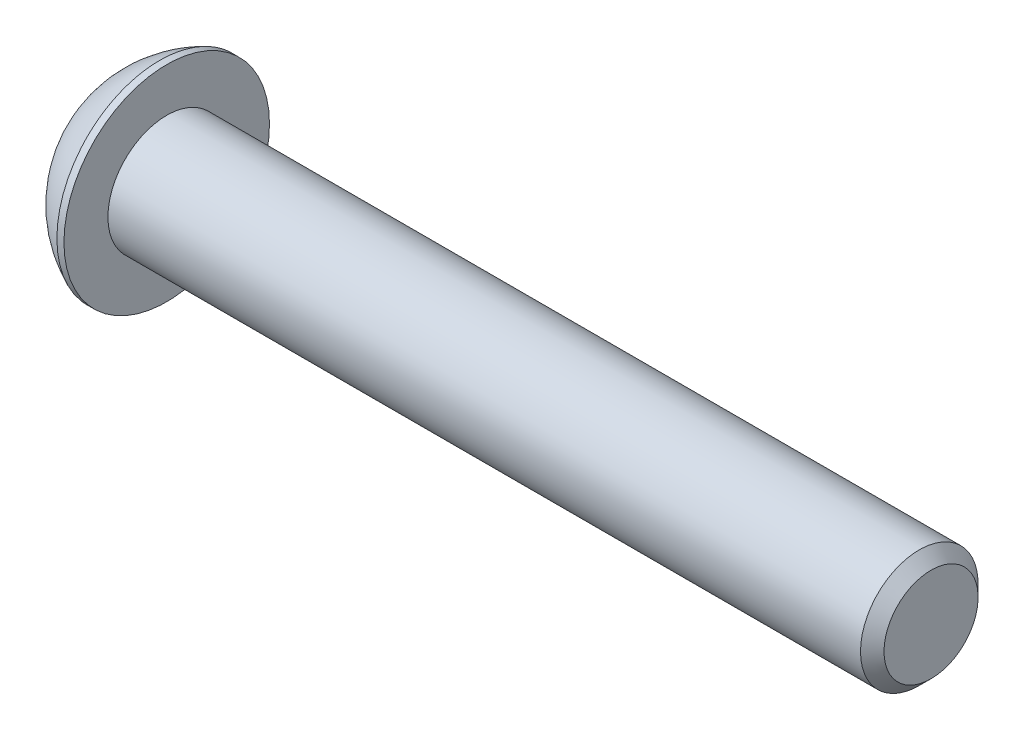
ISO-10303-21;
HEADER;
FILE_DESCRIPTION(('STEP AP214'),'2;1');
FILE_NAME('part.step','',(''),(''),'','','');
FILE_SCHEMA(('AUTOMOTIVE_DESIGN { 1 0 10303 214 1 1 1 1 }'));
ENDSEC;
DATA;
#1=APPLICATION_CONTEXT('core data for automotive mechanical design processes');
#2=APPLICATION_PROTOCOL_DEFINITION('international standard','automotive_design',2000,#1);
#3=PRODUCT_CONTEXT('',#1,'mechanical');
#4=PRODUCT('Part','Part','',(#3));
#5=PRODUCT_RELATED_PRODUCT_CATEGORY('part','',(#4));
#6=PRODUCT_DEFINITION_FORMATION('','',#4);
#7=PRODUCT_DEFINITION_CONTEXT('part definition',#1,'design');
#8=PRODUCT_DEFINITION('design','',#6,#7);
#9=PRODUCT_DEFINITION_SHAPE('','',#8);
#10=(LENGTH_UNIT() NAMED_UNIT(*) SI_UNIT(.MILLI.,.METRE.));
#11=(NAMED_UNIT(*) PLANE_ANGLE_UNIT() SI_UNIT($,.RADIAN.));
#12=(NAMED_UNIT(*) SI_UNIT($,.STERADIAN.) SOLID_ANGLE_UNIT());
#13=UNCERTAINTY_MEASURE_WITH_UNIT(LENGTH_MEASURE(1.E-05),#10,'distance_accuracy_value','');
#14=(GEOMETRIC_REPRESENTATION_CONTEXT(3) GLOBAL_UNCERTAINTY_ASSIGNED_CONTEXT((#13)) GLOBAL_UNIT_ASSIGNED_CONTEXT((#10,
#11,#12)) REPRESENTATION_CONTEXT('',''));
#15=CARTESIAN_POINT('',(0.,0.,0.));
#16=DIRECTION('',(0.,0.,1.));
#17=DIRECTION('',(1.,0.,0.));
#18=AXIS2_PLACEMENT_3D('',#15,#16,#17);
#19=CARTESIAN_POINT('',(1.32080000000034,0.,0.));
#20=DIRECTION('',(-1.,0.,0.));
#21=DIRECTION('',(0.,0.,1.));
#22=AXIS2_PLACEMENT_3D('',#19,#20,#21);
#23=CONICAL_SURFACE('',#22,1.1937999999998,1.04719755119608);
#24=CARTESIAN_POINT('',(2.01004075135902,0.,-4.44089209850063E-13));
#25=VERTEX_POINT('',#24);
#26=VERTEX_LOOP('',#25);
#27=FACE_BOUND('',#26,.T.);
#28=CARTESIAN_POINT('',(1.32080000000009,0.,0.));
#29=DIRECTION('',(-1.,0.,0.));
#30=DIRECTION('',(0.,0.,1.));
#31=AXIS2_PLACEMENT_3D('',#28,#29,#30);
#32=CIRCLE('',#31,1.19380000000024);
#33=CARTESIAN_POINT('',(1.32080000000009,0.,1.19380000000024));
#34=VERTEX_POINT('',#33);
#35=EDGE_CURVE('E20',#34,#34,#32,.T.);
#36=ORIENTED_EDGE('',*,*,#35,.T.);
#37=EDGE_LOOP('',(#36));
#38=FACE_BOUND('',#37,.T.);
#39=ADVANCED_FACE('F17',(#27,#38),#23,.F.);
#40=CARTESIAN_POINT('',(1.3208,-2.29135888084633,0.));
#41=DIRECTION('',(1.,0.,0.));
#42=DIRECTION('',(0.,0.,-1.));
#43=AXIS2_PLACEMENT_3D('',#40,#41,#42);
#44=PLANE('',#43);
#45=DIRECTION('',(0.,1.,0.));
#46=VECTOR('',#45,1.);
#47=CARTESIAN_POINT('',(1.3208,-1.14567944042316,1.984375));
#48=LINE('',#47,#46);
#49=CARTESIAN_POINT('',(1.3208,1.14567944042316,1.984375));
#50=VERTEX_POINT('',#49);
#51=CARTESIAN_POINT('',(1.3208,-1.14567944042316,1.984375));
#52=VERTEX_POINT('',#51);
#53=EDGE_CURVE('E69',#50,#52,#48,.F.);
#54=ORIENTED_EDGE('',*,*,#53,.F.);
#55=DIRECTION('',(0.,0.5,-0.866025403784439));
#56=VECTOR('',#55,1.);
#57=CARTESIAN_POINT('',(1.3208,1.14567944042316,1.984375));
#58=LINE('',#57,#56);
#59=CARTESIAN_POINT('',(1.3208,2.29135888084633,0.));
#60=VERTEX_POINT('',#59);
#61=EDGE_CURVE('E287',#60,#50,#58,.F.);
#62=ORIENTED_EDGE('',*,*,#61,.F.);
#63=DIRECTION('',(0.,-0.5,-0.866025403784439));
#64=VECTOR('',#63,1.);
#65=CARTESIAN_POINT('',(1.3208,2.29135888084633,0.));
#66=LINE('',#65,#64);
#67=CARTESIAN_POINT('',(1.3208,1.14567944042316,-1.984375));
#68=VERTEX_POINT('',#67);
#69=EDGE_CURVE('E291',#68,#60,#66,.F.);
#70=ORIENTED_EDGE('',*,*,#69,.F.);
#71=DIRECTION('',(0.,1.,0.));
#72=VECTOR('',#71,1.);
#73=CARTESIAN_POINT('',(1.3208,1.14567944042316,-1.984375));
#74=LINE('',#73,#72);
#75=CARTESIAN_POINT('',(1.3208,-1.14567944042316,-1.984375));
#76=VERTEX_POINT('',#75);
#77=EDGE_CURVE('E296',#76,#68,#74,.T.);
#78=ORIENTED_EDGE('',*,*,#77,.F.);
#79=DIRECTION('',(0.,-0.500000000000001,0.866025403784438));
#80=VECTOR('',#79,1.);
#81=CARTESIAN_POINT('',(1.3208,-1.14567944042316,-1.984375));
#82=LINE('',#81,#80);
#83=CARTESIAN_POINT('',(1.3208,-2.29135888084633,0.));
#84=VERTEX_POINT('',#83);
#85=EDGE_CURVE('E301',#84,#76,#82,.F.);
#86=ORIENTED_EDGE('',*,*,#85,.F.);
#87=DIRECTION('',(0.,0.500000000000001,0.866025403784438));
#88=VECTOR('',#87,1.);
#89=CARTESIAN_POINT('',(1.3208,-2.29135888084633,0.));
#90=LINE('',#89,#88);
#91=EDGE_CURVE('E82',#52,#84,#90,.F.);
#92=ORIENTED_EDGE('',*,*,#91,.F.);
#93=EDGE_LOOP('',(#54,#62,#70,#78,#86,#92));
#94=FACE_BOUND('',#93,.T.);
#95=ORIENTED_EDGE('',*,*,#35,.F.);
#96=EDGE_LOOP('',(#95));
#97=FACE_BOUND('',#96,.T.);
#98=ADVANCED_FACE('F75',(#94,#97),#44,.F.);
#99=CARTESIAN_POINT('',(1.3208,-1.14567944042316,1.984375));
#100=DIRECTION('',(0.,0.,-1.));
#101=DIRECTION('',(0.,1.,0.));
#102=AXIS2_PLACEMENT_3D('',#99,#100,#101);
#103=PLANE('',#102);
#104=ORIENTED_EDGE('',*,*,#53,.T.);
#105=DIRECTION('',(1.,0.,0.));
#106=VECTOR('',#105,1.);
#107=CARTESIAN_POINT('',(1.3208,-1.14567944042316,1.984375));
#108=LINE('',#107,#106);
#109=CARTESIAN_POINT('',(0.,-1.14567944042316,1.984375));
#110=VERTEX_POINT('',#109);
#111=EDGE_CURVE('E79',#110,#52,#108,.T.);
#112=ORIENTED_EDGE('',*,*,#111,.F.);
#113=DIRECTION('',(0.,1.,0.));
#114=VECTOR('',#113,1.);
#115=CARTESIAN_POINT('',(0.,0.,1.984375));
#116=LINE('',#115,#114);
#117=CARTESIAN_POINT('',(0.,1.14567944042316,1.984375));
#118=VERTEX_POINT('',#117);
#119=EDGE_CURVE('E281',#118,#110,#116,.F.);
#120=ORIENTED_EDGE('',*,*,#119,.F.);
#121=DIRECTION('',(1.,0.,0.));
#122=VECTOR('',#121,1.);
#123=CARTESIAN_POINT('',(1.3208,1.14567944042316,1.984375));
#124=LINE('',#123,#122);
#125=EDGE_CURVE('E284',#50,#118,#124,.F.);
#126=ORIENTED_EDGE('',*,*,#125,.F.);
#127=EDGE_LOOP('',(#104,#112,#120,#126));
#128=FACE_BOUND('',#127,.T.);
#129=ADVANCED_FACE('F128',(#128),#103,.T.);
#130=CARTESIAN_POINT('',(1.3208,-2.29135888084633,0.));
#131=DIRECTION('',(0.,0.866025403784438,-0.500000000000001));
#132=DIRECTION('',(0.,0.500000000000001,0.866025403784438));
#133=AXIS2_PLACEMENT_3D('',#130,#131,#132);
#134=PLANE('',#133);
#135=ORIENTED_EDGE('',*,*,#91,.T.);
#136=DIRECTION('',(1.,0.,0.));
#137=VECTOR('',#136,1.);
#138=CARTESIAN_POINT('',(1.3208,-2.29135888084633,0.));
#139=LINE('',#138,#137);
#140=CARTESIAN_POINT('',(0.,-2.29135888084633,0.));
#141=VERTEX_POINT('',#140);
#142=EDGE_CURVE('E303',#141,#84,#139,.T.);
#143=ORIENTED_EDGE('',*,*,#142,.F.);
#144=DIRECTION('',(0.,-0.500000000000001,-0.866025403784438));
#145=VECTOR('',#144,1.);
#146=CARTESIAN_POINT('',(0.,-1.14567944042316,1.984375));
#147=LINE('',#146,#145);
#148=EDGE_CURVE('E278',#110,#141,#147,.T.);
#149=ORIENTED_EDGE('',*,*,#148,.F.);
#150=ORIENTED_EDGE('',*,*,#111,.T.);
#151=EDGE_LOOP('',(#135,#143,#149,#150));
#152=FACE_BOUND('',#151,.T.);
#153=ADVANCED_FACE('F124',(#152),#134,.T.);
#154=CARTESIAN_POINT('',(1.3208,-1.14567944042316,-1.984375));
#155=DIRECTION('',(0.,0.866025403784438,0.500000000000001));
#156=DIRECTION('',(0.,-0.500000000000001,0.866025403784438));
#157=AXIS2_PLACEMENT_3D('',#154,#155,#156);
#158=PLANE('',#157);
#159=ORIENTED_EDGE('',*,*,#85,.T.);
#160=DIRECTION('',(1.,0.,0.));
#161=VECTOR('',#160,1.);
#162=CARTESIAN_POINT('',(1.3208,-1.14567944042316,-1.984375));
#163=LINE('',#162,#161);
#164=CARTESIAN_POINT('',(0.,-1.14567944042316,-1.984375));
#165=VERTEX_POINT('',#164);
#166=EDGE_CURVE('E298',#165,#76,#163,.T.);
#167=ORIENTED_EDGE('',*,*,#166,.F.);
#168=DIRECTION('',(0.,0.500000000000001,-0.866025403784438));
#169=VECTOR('',#168,1.);
#170=CARTESIAN_POINT('',(0.,-2.29135888084633,0.));
#171=LINE('',#170,#169);
#172=EDGE_CURVE('E275',#141,#165,#171,.T.);
#173=ORIENTED_EDGE('',*,*,#172,.F.);
#174=ORIENTED_EDGE('',*,*,#142,.T.);
#175=EDGE_LOOP('',(#159,#167,#173,#174));
#176=FACE_BOUND('',#175,.T.);
#177=ADVANCED_FACE('F120',(#176),#158,.T.);
#178=CARTESIAN_POINT('',(1.3208,1.14567944042316,-1.984375));
#179=DIRECTION('',(0.,0.,1.));
#180=DIRECTION('',(1.,0.,0.));
#181=AXIS2_PLACEMENT_3D('',#178,#179,#180);
#182=PLANE('',#181);
#183=ORIENTED_EDGE('',*,*,#77,.T.);
#184=DIRECTION('',(1.,0.,0.));
#185=VECTOR('',#184,1.);
#186=CARTESIAN_POINT('',(1.3208,1.14567944042316,-1.984375));
#187=LINE('',#186,#185);
#188=CARTESIAN_POINT('',(0.,1.14567944042316,-1.984375));
#189=VERTEX_POINT('',#188);
#190=EDGE_CURVE('E293',#189,#68,#187,.T.);
#191=ORIENTED_EDGE('',*,*,#190,.F.);
#192=DIRECTION('',(0.,1.,0.));
#193=VECTOR('',#192,1.);
#194=CARTESIAN_POINT('',(0.,0.,-1.984375));
#195=LINE('',#194,#193);
#196=EDGE_CURVE('E272',#165,#189,#195,.T.);
#197=ORIENTED_EDGE('',*,*,#196,.F.);
#198=ORIENTED_EDGE('',*,*,#166,.T.);
#199=EDGE_LOOP('',(#183,#191,#197,#198));
#200=FACE_BOUND('',#199,.T.);
#201=ADVANCED_FACE('F117',(#200),#182,.T.);
#202=CARTESIAN_POINT('',(1.3208,2.29135888084633,0.));
#203=DIRECTION('',(0.,-0.866025403784439,0.5));
#204=DIRECTION('',(0.,-0.5,-0.866025403784439));
#205=AXIS2_PLACEMENT_3D('',#202,#203,#204);
#206=PLANE('',#205);
#207=ORIENTED_EDGE('',*,*,#69,.T.);
#208=DIRECTION('',(1.,0.,0.));
#209=VECTOR('',#208,1.);
#210=CARTESIAN_POINT('',(1.3208,2.29135888084633,0.));
#211=LINE('',#210,#209);
#212=CARTESIAN_POINT('',(0.,2.29135888084633,0.));
#213=VERTEX_POINT('',#212);
#214=EDGE_CURVE('E35',#213,#60,#211,.T.);
#215=ORIENTED_EDGE('',*,*,#214,.F.);
#216=DIRECTION('',(0.,0.5,0.866025403784439));
#217=VECTOR('',#216,1.);
#218=CARTESIAN_POINT('',(0.,1.14567944042316,-1.984375));
#219=LINE('',#218,#217);
#220=EDGE_CURVE('E269',#189,#213,#219,.T.);
#221=ORIENTED_EDGE('',*,*,#220,.F.);
#222=ORIENTED_EDGE('',*,*,#190,.T.);
#223=EDGE_LOOP('',(#207,#215,#221,#222));
#224=FACE_BOUND('',#223,.T.);
#225=ADVANCED_FACE('F113',(#224),#206,.T.);
#226=CARTESIAN_POINT('',(1.3208,1.14567944042316,1.984375));
#227=DIRECTION('',(0.,-0.866025403784439,-0.5));
#228=DIRECTION('',(0.,0.5,-0.866025403784439));
#229=AXIS2_PLACEMENT_3D('',#226,#227,#228);
#230=PLANE('',#229);
#231=ORIENTED_EDGE('',*,*,#61,.T.);
#232=ORIENTED_EDGE('',*,*,#125,.T.);
#233=DIRECTION('',(0.,-0.5,0.866025403784438));
#234=VECTOR('',#233,1.);
#235=CARTESIAN_POINT('',(0.,2.29135888084633,0.));
#236=LINE('',#235,#234);
#237=EDGE_CURVE('E100',#213,#118,#236,.T.);
#238=ORIENTED_EDGE('',*,*,#237,.F.);
#239=ORIENTED_EDGE('',*,*,#214,.T.);
#240=EDGE_LOOP('',(#231,#232,#238,#239));
#241=FACE_BOUND('',#240,.T.);
#242=ADVANCED_FACE('F109',(#241),#230,.T.);
#243=CARTESIAN_POINT('',(0.,0.,0.));
#244=DIRECTION('',(-1.,0.,0.));
#245=DIRECTION('',(0.,0.,1.));
#246=AXIS2_PLACEMENT_3D('',#243,#244,#245);
#247=PLANE('',#246);
#248=ORIENTED_EDGE('',*,*,#220,.T.);
#249=ORIENTED_EDGE('',*,*,#237,.T.);
#250=ORIENTED_EDGE('',*,*,#119,.T.);
#251=ORIENTED_EDGE('',*,*,#148,.T.);
#252=ORIENTED_EDGE('',*,*,#172,.T.);
#253=ORIENTED_EDGE('',*,*,#196,.T.);
#254=EDGE_LOOP('',(#248,#249,#250,#251,#252,#253));
#255=FACE_BOUND('',#254,.T.);
#256=CARTESIAN_POINT('',(0.,2.77495,0.));
#257=CARTESIAN_POINT('',(0.,2.77494953309947,0.0779118937523459));
#258=CARTESIAN_POINT('',(0.,2.77166578388025,0.15583810591977));
#259=CARTESIAN_POINT('',(0.,2.75855213600204,0.311152012455904));
#260=CARTESIAN_POINT('',(0.,2.74872030471467,0.388539541019556));
#261=CARTESIAN_POINT('',(0.,2.72255472645676,0.542341518735717));
#262=CARTESIAN_POINT('',(-2.70414110576258E-13,2.70621065843663,0.618754223567578));
#263=CARTESIAN_POINT('',(2.71501725221868E-13,2.66713326915777,0.769973634286023));
#264=CARTESIAN_POINT('',(1.01274952524446E-12,2.64439476297869,0.844778983646282));
#265=CARTESIAN_POINT('',(1.81909959813207E-12,2.56690195943351,1.06566239301792));
#266=CARTESIAN_POINT('',(4.77081687541822E-13,2.50280672569928,1.20857954243987));
#267=CARTESIAN_POINT('',(-4.76232447128612E-13,2.35149826934097,1.48160874561538));
#268=CARTESIAN_POINT('',(0.,2.26428416790397,1.61172031233499));
#269=CARTESIAN_POINT('',(0.,2.1181093928834,1.79445660654268));
#270=CARTESIAN_POINT('',(0.,2.06678693791626,1.85333128513996));
#271=CARTESIAN_POINT('',(0.,1.95940522984449,1.96650727912792));
#272=CARTESIAN_POINT('',(0.,1.90335059143535,2.02081294920044));
#273=CARTESIAN_POINT('',(0.,1.78683891013963,2.12453280878582));
#274=CARTESIAN_POINT('',(0.,1.72637988450322,2.1739447713554));
#275=CARTESIAN_POINT('',(0.,1.60151968865711,2.26750481692908));
#276=CARTESIAN_POINT('',(0.,1.53711760864537,2.31165167810847));
#277=CARTESIAN_POINT('',(0.,1.33869902291632,2.43567242603944));
#278=CARTESIAN_POINT('',(0.,1.19934704110695,2.507235886628));
#279=CARTESIAN_POINT('',(0.,0.910681609121881,2.62590828672821));
#280=CARTESIAN_POINT('',(0.,0.761368265357398,2.67301748742278));
#281=CARTESIAN_POINT('',(0.,0.456932649466623,2.74151230664007));
#282=CARTESIAN_POINT('',(0.,0.301810346322584,2.76289778778721));
#283=CARTESIAN_POINT('',(0.,-0.00982263870895171,2.77931595661156));
#284=CARTESIAN_POINT('',(0.,-0.166333320596448,2.77434864428877));
#285=CARTESIAN_POINT('',(0.,-0.476280836814452,2.73822217653073));
#286=CARTESIAN_POINT('',(0.,-0.629717687555985,2.70706316096981));
#287=CARTESIAN_POINT('',(0.,-0.929254830044274,2.61937980771149));
#288=CARTESIAN_POINT('',(0.,-1.0753550434132,2.56285519909568));
#289=CARTESIAN_POINT('',(0.,-1.28570692598579,2.46037024128109));
#290=CARTESIAN_POINT('',(0.,-1.35439130022287,2.42323494812896));
#291=CARTESIAN_POINT('',(0.,-1.488391287199,2.34331277270256));
#292=CARTESIAN_POINT('',(0.,-1.55370767631787,2.30052720108831));
#293=CARTESIAN_POINT('',(0.,-1.68047292776594,2.20962421887055));
#294=CARTESIAN_POINT('',(0.,-1.7419235278682,2.16150923122348));
#295=CARTESIAN_POINT('',(0.,-1.86060297067992,2.06024311301283));
#296=CARTESIAN_POINT('',(0.,-1.91782768181715,2.0070871669763));
#297=CARTESIAN_POINT('',(0.,-2.08239462196651,1.8407220856554));
#298=CARTESIAN_POINT('',(0.,-2.18279764272601,1.72049499758422));
#299=CARTESIAN_POINT('',(0.,-2.36195754944063,1.46487629213018));
#300=CARTESIAN_POINT('',(0.,-2.44071525816758,1.32948525142807));
#301=CARTESIAN_POINT('',(0.,-2.54098882695274,1.11796734074395));
#302=CARTESIAN_POINT('',(0.,-2.57146177392727,1.04596540008347));
#303=CARTESIAN_POINT('',(0.,-2.62621251108999,0.899689259475764));
#304=CARTESIAN_POINT('',(0.,-2.65049531495563,0.825416953360952));
#305=CARTESIAN_POINT('',(0.,-2.69267708798766,0.675215808695207));
#306=CARTESIAN_POINT('',(0.,-2.71058613777937,0.599289789313092));
#307=CARTESIAN_POINT('',(0.,-2.73994710360127,0.446213628496932));
#308=CARTESIAN_POINT('',(0.,-2.75140092413871,0.369063855024788));
#309=CARTESIAN_POINT('',(0.,-2.76470470685522,0.24316208817343));
#310=CARTESIAN_POINT('',(0.,-2.76854547596618,0.194611672428577));
#311=CARTESIAN_POINT('',(0.,-2.77366826843264,0.0973760351839812));
#312=CARTESIAN_POINT('',(0.,-2.77495029178814,0.0486908136842395));
#313=CARTESIAN_POINT('',(0.,-2.77494953309947,-0.0779118937523475));
#314=CARTESIAN_POINT('',(0.,-2.77166578388025,-0.155838105919772));
#315=CARTESIAN_POINT('',(0.,-2.75855213600204,-0.311152012455906));
#316=CARTESIAN_POINT('',(0.,-2.74872030471467,-0.388539541019558));
#317=CARTESIAN_POINT('',(0.,-2.72255472645677,-0.542341518735719));
#318=CARTESIAN_POINT('',(-2.70149297926331E-13,-2.70621065843663,-0.61875422356758));
#319=CARTESIAN_POINT('',(2.712366972268E-13,-2.66713326915777,-0.769973634286024));
#320=CARTESIAN_POINT('',(1.0114146773846E-12,-2.64439476297869,-0.844778983646283));
#321=CARTESIAN_POINT('',(1.81656702958366E-12,-2.5669019594335,-1.06566239301792));
#322=CARTESIAN_POINT('',(4.7641829195856E-13,-2.50280672569928,-1.20857954243988));
#323=CARTESIAN_POINT('',(-4.75569026324205E-13,-2.35149826934097,-1.48160874561538));
#324=CARTESIAN_POINT('',(0.,-2.26428416790396,-1.61172031233499));
#325=CARTESIAN_POINT('',(0.,-2.1181093928834,-1.79445660654268));
#326=CARTESIAN_POINT('',(0.,-2.06678693791626,-1.85333128513997));
#327=CARTESIAN_POINT('',(0.,-1.95940522984449,-1.96650727912792));
#328=CARTESIAN_POINT('',(0.,-1.90335059143535,-2.02081294920044));
#329=CARTESIAN_POINT('',(0.,-1.78683891013963,-2.12453280878582));
#330=CARTESIAN_POINT('',(0.,-1.72637988450322,-2.1739447713554));
#331=CARTESIAN_POINT('',(0.,-1.60151968865711,-2.26750481692908));
#332=CARTESIAN_POINT('',(0.,-1.53711760864537,-2.31165167810847));
#333=CARTESIAN_POINT('',(0.,-1.33869902291632,-2.43567242603944));
#334=CARTESIAN_POINT('',(0.,-1.19934704110695,-2.507235886628));
#335=CARTESIAN_POINT('',(0.,-0.91068160912188,-2.62590828672821));
#336=CARTESIAN_POINT('',(0.,-0.761368265357396,-2.67301748742278));
#337=CARTESIAN_POINT('',(0.,-0.456932649466621,-2.74151230664007));
#338=CARTESIAN_POINT('',(0.,-0.301810346322582,-2.76289778778721));
#339=CARTESIAN_POINT('',(0.,0.00982263870895353,-2.77931595661156));
#340=CARTESIAN_POINT('',(0.,0.16633332059645,-2.77434864428876));
#341=CARTESIAN_POINT('',(0.,0.476280836814454,-2.73822217653073));
#342=CARTESIAN_POINT('',(0.,0.629717687555987,-2.70706316096981));
#343=CARTESIAN_POINT('',(0.,0.929254830044276,-2.6193798077115));
#344=CARTESIAN_POINT('',(0.,1.0753550434132,-2.56285519909568));
#345=CARTESIAN_POINT('',(0.,1.28570692598579,-2.46037024128109));
#346=CARTESIAN_POINT('',(0.,1.35439130022287,-2.42323494812896));
#347=CARTESIAN_POINT('',(0.,1.488391287199,-2.34331277270256));
#348=CARTESIAN_POINT('',(0.,1.55370767631787,-2.30052720108831));
#349=CARTESIAN_POINT('',(0.,1.68047292776594,-2.20962421887055));
#350=CARTESIAN_POINT('',(0.,1.7419235278682,-2.16150923122348));
#351=CARTESIAN_POINT('',(0.,1.86060297067992,-2.06024311301282));
#352=CARTESIAN_POINT('',(0.,1.91782768181716,-2.0070871669763));
#353=CARTESIAN_POINT('',(0.,2.08239462196651,-1.8407220856554));
#354=CARTESIAN_POINT('',(0.,2.18279764272601,-1.72049499758422));
#355=CARTESIAN_POINT('',(0.,2.36195754944063,-1.46487629213018));
#356=CARTESIAN_POINT('',(0.,2.44071525816757,-1.32948525142807));
#357=CARTESIAN_POINT('',(0.,2.54098882695273,-1.11796734074395));
#358=CARTESIAN_POINT('',(0.,2.57146177392727,-1.04596540008347));
#359=CARTESIAN_POINT('',(0.,2.62621251108999,-0.899689259475765));
#360=CARTESIAN_POINT('',(0.,2.65049531495563,-0.825416953360953));
#361=CARTESIAN_POINT('',(0.,2.69267708798766,-0.675215808695207));
#362=CARTESIAN_POINT('',(0.,2.71058613777936,-0.599289789313092));
#363=CARTESIAN_POINT('',(0.,2.73994710360127,-0.446213628496932));
#364=CARTESIAN_POINT('',(0.,2.75140092413871,-0.369063855024789));
#365=CARTESIAN_POINT('',(0.,2.76470470685522,-0.243162088173432));
#366=CARTESIAN_POINT('',(0.,2.76854547596618,-0.194611672428578));
#367=CARTESIAN_POINT('',(0.,2.77366826843264,-0.0973760351839823));
#368=CARTESIAN_POINT('',(0.,2.77495029178814,-0.0486908136842408));
#369=CARTESIAN_POINT('',(0.,2.77495,0.));
#370=B_SPLINE_CURVE_WITH_KNOTS('',3,(#256,#257,#258,#259,#260,#261,#262,#263,#264,#265,#266,
#267,#268,#269,#270,#271,#272,#273,#274,#275,#276,#277,#278,#279,#280,#281,#282,#283,#284,#285,
#286,#287,#288,#289,#290,#291,#292,#293,#294,#295,#296,#297,#298,#299,#300,#301,#302,#303,#304,
#305,#306,#307,#308,#309,#310,#311,#312,#313,#314,#315,#316,#317,#318,#319,#320,#321,#322,#323,
#324,#325,#326,#327,#328,#329,#330,#331,#332,#333,#334,#335,#336,#337,#338,#339,#340,#341,#342,
#343,#344,#345,#346,#347,#348,#349,#350,#351,#352,#353,#354,#355,#356,#357,#358,#359,#360,#361,
#362,#363,#364,#365,#366,#367,#368,#369),.UNSPECIFIED.,.T.,.F.,(4,2,2,2,2,2,2,2,2,2,2,2,2,2,2,2,
2,2,2,2,2,2,2,2,2,2,2,2,2,2,2,2,2,2,2,2,2,2,2,2,2,2,2,2,2,2,2,2,2,2,2,2,2,2,2,2,4),(0.,
0.233690856748162,0.467450716578751,0.701582538521471,0.935904756015414,1.40343220467667,
1.87097742791502,2.10505636898837,2.33890962270652,2.57286880998746,2.80688218486306,
3.27442101763127,3.74195485676357,4.20949119271389,4.67702752866417,5.14456136779641,
5.61210020056468,5.84611357544033,6.08007276272136,6.31392601643949,6.54800495751273,
7.01555018075072,7.48307762941212,7.71739984690652,7.95153166884955,8.18529152868023,
8.41898238542855,8.56502681353347,8.71107124163843,8.94476209838659,9.17852195821718,
9.4126537801599,9.64697599765384,10.1145034463151,10.5820486695534,10.8161276106268,
11.0499808643449,11.2839400516259,11.5179534265015,11.9854922592697,12.453026098402,
12.9205624343523,13.3880987703026,13.8556326094348,14.3231714422031,14.5571848170788,
14.7911440043598,15.0249972580779,15.2590761991512,15.7266214223891,16.1941488710506,
16.4284710885449,16.662602910488,16.8963627703186,17.130053627067,17.2760980551719,
17.4221424832769),.UNSPECIFIED.);
#371=CARTESIAN_POINT('',(0.,2.77495,0.));
#372=VERTEX_POINT('',#371);
#373=EDGE_CURVE('E94',#372,#372,#370,.T.);
#374=ORIENTED_EDGE('',*,*,#373,.F.);
#375=EDGE_LOOP('',(#374));
#376=FACE_BOUND('',#375,.T.);
#377=ADVANCED_FACE('F105',(#255,#376),#247,.T.);
#378=CARTESIAN_POINT('',(5.37260881410256,0.,0.));
#379=DIRECTION('',(0.,1.,0.));
#380=DIRECTION('',(1.,0.,0.));
#381=AXIS2_PLACEMENT_3D('',#378,#379,#380);
#382=SPHERICAL_SURFACE('',#381,6.04692260342999);
#383=CARTESIAN_POINT('',(2.9718,0.,0.));
#384=DIRECTION('',(-1.,0.,0.));
#385=DIRECTION('',(0.,0.,1.));
#386=AXIS2_PLACEMENT_3D('',#383,#384,#385);
#387=CIRCLE('',#386,5.5499);
#388=CARTESIAN_POINT('',(2.9718,0.,5.5499));
#389=VERTEX_POINT('',#388);
#390=EDGE_CURVE('E92',#389,#389,#387,.F.);
#391=ORIENTED_EDGE('',*,*,#390,.F.);
#392=EDGE_LOOP('',(#391));
#393=FACE_BOUND('',#392,.T.);
#394=ORIENTED_EDGE('',*,*,#373,.T.);
#395=EDGE_LOOP('',(#394));
#396=FACE_BOUND('',#395,.T.);
#397=ADVANCED_FACE('F101',(#393,#396),#382,.T.);
#398=CARTESIAN_POINT('',(44.6278,0.,0.));
#399=DIRECTION('',(-1.,0.,0.));
#400=DIRECTION('',(0.,0.,1.));
#401=AXIS2_PLACEMENT_3D('',#398,#399,#400);
#402=PLANE('',#401);
#403=CARTESIAN_POINT('',(44.6278000000575,0.,0.));
#404=DIRECTION('',(-1.,0.,0.));
#405=DIRECTION('',(0.,0.,1.));
#406=AXIS2_PLACEMENT_3D('',#403,#404,#405);
#407=CIRCLE('',#406,2.53999999995358);
#408=CARTESIAN_POINT('',(44.6278000000575,0.,2.53999999995358));
#409=VERTEX_POINT('',#408);
#410=EDGE_CURVE('E89',#409,#409,#407,.T.);
#411=ORIENTED_EDGE('',*,*,#410,.F.);
#412=EDGE_LOOP('',(#411));
#413=FACE_BOUND('',#412,.T.);
#414=ADVANCED_FACE('F154',(#413),#402,.F.);
#415=CARTESIAN_POINT('',(0.,0.,0.));
#416=DIRECTION('',(-1.,0.,0.));
#417=DIRECTION('',(0.,0.,1.));
#418=AXIS2_PLACEMENT_3D('',#415,#416,#417);
#419=CYLINDRICAL_SURFACE('',#418,5.5499);
#420=ORIENTED_EDGE('',*,*,#390,.T.);
#421=EDGE_LOOP('',(#420));
#422=FACE_BOUND('',#421,.T.);
#423=CARTESIAN_POINT('',(3.3528,0.,0.));
#424=DIRECTION('',(-1.,0.,0.));
#425=DIRECTION('',(0.,0.,1.));
#426=AXIS2_PLACEMENT_3D('',#423,#424,#425);
#427=CIRCLE('',#426,5.5499);
#428=CARTESIAN_POINT('',(3.3528,0.,5.5499));
#429=VERTEX_POINT('',#428);
#430=EDGE_CURVE('E86',#429,#429,#427,.T.);
#431=ORIENTED_EDGE('',*,*,#430,.T.);
#432=EDGE_LOOP('',(#431));
#433=FACE_BOUND('',#432,.T.);
#434=ADVANCED_FACE('F151',(#422,#433),#419,.T.);
#435=CARTESIAN_POINT('',(43.9928000000691,0.,0.));
#436=DIRECTION('',(-1.,0.,0.));
#437=DIRECTION('',(0.,0.,1.));
#438=AXIS2_PLACEMENT_3D('',#435,#436,#437);
#439=CONICAL_SURFACE('',#438,3.17499999994197,0.785398163397448);
#440=CARTESIAN_POINT('',(43.9928,0.,0.));
#441=DIRECTION('',(-1.,0.,0.));
#442=DIRECTION('',(0.,0.,1.));
#443=AXIS2_PLACEMENT_3D('',#440,#441,#442);
#444=CIRCLE('',#443,3.175);
#445=CARTESIAN_POINT('',(43.9928,0.,3.175));
#446=VERTEX_POINT('',#445);
#447=EDGE_CURVE('E26',#446,#446,#444,.T.);
#448=ORIENTED_EDGE('',*,*,#447,.F.);
#449=EDGE_LOOP('',(#448));
#450=FACE_BOUND('',#449,.T.);
#451=ORIENTED_EDGE('',*,*,#410,.T.);
#452=EDGE_LOOP('',(#451));
#453=FACE_BOUND('',#452,.T.);
#454=ADVANCED_FACE('F144',(#450,#453),#439,.T.);
#455=CARTESIAN_POINT('',(3.3528,3.175,0.));
#456=DIRECTION('',(-1.,0.,0.));
#457=DIRECTION('',(0.,0.,1.));
#458=AXIS2_PLACEMENT_3D('',#455,#456,#457);
#459=PLANE('',#458);
#460=CARTESIAN_POINT('',(3.3528,0.,0.));
#461=DIRECTION('',(-1.,0.,0.));
#462=DIRECTION('',(0.,0.,1.));
#463=AXIS2_PLACEMENT_3D('',#460,#461,#462);
#464=CIRCLE('',#463,3.175);
#465=CARTESIAN_POINT('',(3.3528,0.,3.175));
#466=VERTEX_POINT('',#465);
#467=EDGE_CURVE('E11',#466,#466,#464,.F.);
#468=ORIENTED_EDGE('',*,*,#467,.F.);
#469=EDGE_LOOP('',(#468));
#470=FACE_BOUND('',#469,.T.);
#471=ORIENTED_EDGE('',*,*,#430,.F.);
#472=EDGE_LOOP('',(#471));
#473=FACE_BOUND('',#472,.T.);
#474=ADVANCED_FACE('F138',(#470,#473),#459,.F.);
#475=CARTESIAN_POINT('',(0.,0.,0.));
#476=DIRECTION('',(-1.,0.,0.));
#477=DIRECTION('',(0.,0.,1.));
#478=AXIS2_PLACEMENT_3D('',#475,#476,#477);
#479=CYLINDRICAL_SURFACE('',#478,3.175);
#480=ORIENTED_EDGE('',*,*,#467,.T.);
#481=EDGE_LOOP('',(#480));
#482=FACE_BOUND('',#481,.T.);
#483=ORIENTED_EDGE('',*,*,#447,.T.);
#484=EDGE_LOOP('',(#483));
#485=FACE_BOUND('',#484,.T.);
#486=ADVANCED_FACE('F136',(#482,#485),#479,.T.);
#487=CLOSED_SHELL('',(#39,#98,#129,#153,#177,#201,#225,#242,#377,#397,#414,#434,#454,#474,#486));
#488=MANIFOLD_SOLID_BREP('B1',#487);
#489=ADVANCED_BREP_SHAPE_REPRESENTATION('',(#18,#488),#14);
#490=SHAPE_DEFINITION_REPRESENTATION(#9,#489);
ENDSEC;
END-ISO-10303-21;
